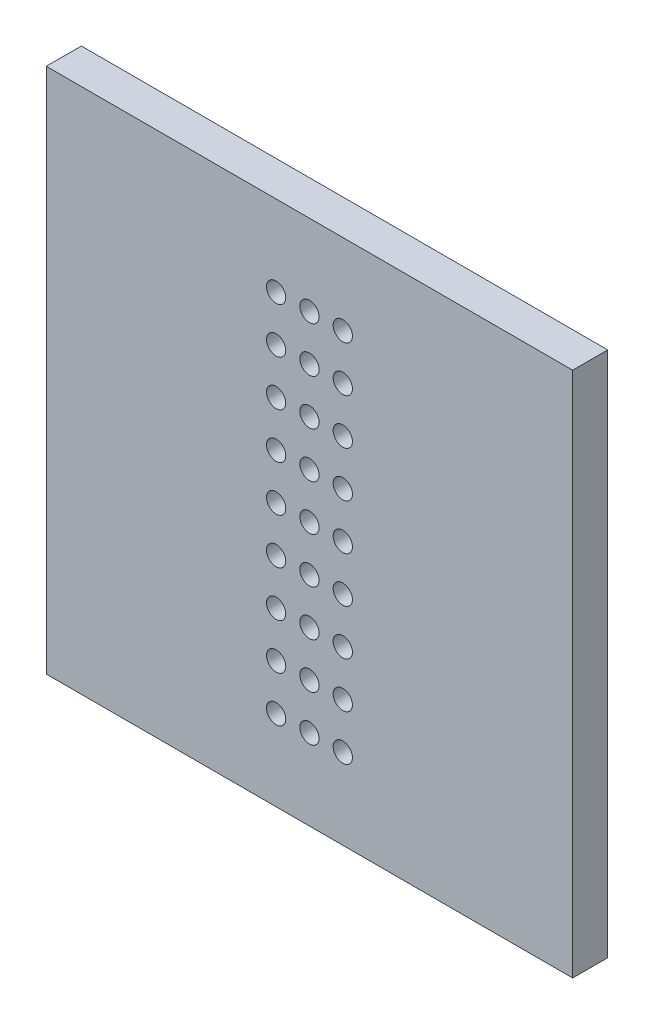
ISO-10303-21;
HEADER;
FILE_DESCRIPTION(('STEP AP214'),'2;1');
FILE_NAME('part.step','',(''),(''),'','','');
FILE_SCHEMA(('AUTOMOTIVE_DESIGN { 1 0 10303 214 1 1 1 1 }'));
ENDSEC;
DATA;
#1=APPLICATION_CONTEXT('core data for automotive mechanical design processes');
#2=APPLICATION_PROTOCOL_DEFINITION('international standard','automotive_design',2000,#1);
#3=PRODUCT_CONTEXT('',#1,'mechanical');
#4=PRODUCT('Part','Part','',(#3));
#5=PRODUCT_RELATED_PRODUCT_CATEGORY('part','',(#4));
#6=PRODUCT_DEFINITION_FORMATION('','',#4);
#7=PRODUCT_DEFINITION_CONTEXT('part definition',#1,'design');
#8=PRODUCT_DEFINITION('design','',#6,#7);
#9=PRODUCT_DEFINITION_SHAPE('','',#8);
#10=(LENGTH_UNIT() NAMED_UNIT(*) SI_UNIT(.MILLI.,.METRE.));
#11=(NAMED_UNIT(*) PLANE_ANGLE_UNIT() SI_UNIT($,.RADIAN.));
#12=(NAMED_UNIT(*) SI_UNIT($,.STERADIAN.) SOLID_ANGLE_UNIT());
#13=UNCERTAINTY_MEASURE_WITH_UNIT(LENGTH_MEASURE(1.E-05),#10,'distance_accuracy_value','');
#14=(GEOMETRIC_REPRESENTATION_CONTEXT(3) GLOBAL_UNCERTAINTY_ASSIGNED_CONTEXT((#13)) GLOBAL_UNIT_ASSIGNED_CONTEXT((#10,
#11,#12)) REPRESENTATION_CONTEXT('',''));
#15=CARTESIAN_POINT('',(0.,0.,0.));
#16=DIRECTION('',(0.,0.,1.));
#17=DIRECTION('',(1.,0.,0.));
#18=AXIS2_PLACEMENT_3D('',#15,#16,#17);
#19=CARTESIAN_POINT('',(15.,-15.,2.));
#20=DIRECTION('',(-1.,0.,0.));
#21=DIRECTION('',(0.,0.,1.));
#22=AXIS2_PLACEMENT_3D('',#19,#20,#21);
#23=PLANE('',#22);
#24=DIRECTION('',(0.,1.,0.));
#25=VECTOR('',#24,1.);
#26=CARTESIAN_POINT('',(15.,-15.,0.));
#27=LINE('',#26,#25);
#28=CARTESIAN_POINT('',(15.,-15.,0.));
#29=VERTEX_POINT('',#28);
#30=CARTESIAN_POINT('',(15.,15.,0.));
#31=VERTEX_POINT('',#30);
#32=EDGE_CURVE('E103',#29,#31,#27,.T.);
#33=ORIENTED_EDGE('',*,*,#32,.T.);
#34=DIRECTION('',(0.,0.,-1.));
#35=VECTOR('',#34,1.);
#36=CARTESIAN_POINT('',(15.,15.,2.));
#37=LINE('',#36,#35);
#38=CARTESIAN_POINT('',(15.,15.,2.));
#39=VERTEX_POINT('',#38);
#40=EDGE_CURVE('E11',#39,#31,#37,.T.);
#41=ORIENTED_EDGE('',*,*,#40,.F.);
#42=DIRECTION('',(0.,1.,0.));
#43=VECTOR('',#42,1.);
#44=CARTESIAN_POINT('',(15.,-15.,2.));
#45=LINE('',#44,#43);
#46=CARTESIAN_POINT('',(15.,-15.,2.));
#47=VERTEX_POINT('',#46);
#48=EDGE_CURVE('E90',#47,#39,#45,.T.);
#49=ORIENTED_EDGE('',*,*,#48,.F.);
#50=DIRECTION('',(0.,0.,-1.));
#51=VECTOR('',#50,1.);
#52=CARTESIAN_POINT('',(15.,-15.,2.));
#53=LINE('',#52,#51);
#54=EDGE_CURVE('E99',#47,#29,#53,.T.);
#55=ORIENTED_EDGE('',*,*,#54,.T.);
#56=EDGE_LOOP('',(#33,#41,#49,#55));
#57=FACE_BOUND('',#56,.T.);
#58=ADVANCED_FACE('F37',(#57),#23,.F.);
#59=CARTESIAN_POINT('',(-15.,15.,2.));
#60=DIRECTION('',(0.,-1.,0.));
#61=DIRECTION('',(0.,0.,-1.));
#62=AXIS2_PLACEMENT_3D('',#59,#60,#61);
#63=PLANE('',#62);
#64=DIRECTION('',(-1.,0.,0.));
#65=VECTOR('',#64,1.);
#66=CARTESIAN_POINT('',(-15.,15.,0.));
#67=LINE('',#66,#65);
#68=CARTESIAN_POINT('',(-15.,15.,0.));
#69=VERTEX_POINT('',#68);
#70=EDGE_CURVE('E94',#31,#69,#67,.T.);
#71=ORIENTED_EDGE('',*,*,#70,.T.);
#72=DIRECTION('',(0.,0.,-1.));
#73=VECTOR('',#72,1.);
#74=CARTESIAN_POINT('',(-15.,15.,2.));
#75=LINE('',#74,#73);
#76=CARTESIAN_POINT('',(-15.,15.,2.));
#77=VERTEX_POINT('',#76);
#78=EDGE_CURVE('E46',#77,#69,#75,.T.);
#79=ORIENTED_EDGE('',*,*,#78,.F.);
#80=DIRECTION('',(-1.,0.,0.));
#81=VECTOR('',#80,1.);
#82=CARTESIAN_POINT('',(-15.,15.,2.));
#83=LINE('',#82,#81);
#84=EDGE_CURVE('E85',#39,#77,#83,.T.);
#85=ORIENTED_EDGE('',*,*,#84,.F.);
#86=ORIENTED_EDGE('',*,*,#40,.T.);
#87=EDGE_LOOP('',(#71,#79,#85,#86));
#88=FACE_BOUND('',#87,.T.);
#89=ADVANCED_FACE('F93',(#88),#63,.F.);
#90=CARTESIAN_POINT('',(-15.,-15.,2.));
#91=DIRECTION('',(1.,0.,0.));
#92=DIRECTION('',(0.,0.,-1.));
#93=AXIS2_PLACEMENT_3D('',#90,#91,#92);
#94=PLANE('',#93);
#95=DIRECTION('',(0.,-1.,0.));
#96=VECTOR('',#95,1.);
#97=CARTESIAN_POINT('',(-15.,-15.,0.));
#98=LINE('',#97,#96);
#99=CARTESIAN_POINT('',(-15.,-15.,0.));
#100=VERTEX_POINT('',#99);
#101=EDGE_CURVE('E72',#69,#100,#98,.T.);
#102=ORIENTED_EDGE('',*,*,#101,.T.);
#103=DIRECTION('',(0.,0.,-1.));
#104=VECTOR('',#103,1.);
#105=CARTESIAN_POINT('',(-15.,-15.,2.));
#106=LINE('',#105,#104);
#107=CARTESIAN_POINT('',(-15.,-15.,2.));
#108=VERTEX_POINT('',#107);
#109=EDGE_CURVE('E95',#108,#100,#106,.T.);
#110=ORIENTED_EDGE('',*,*,#109,.F.);
#111=DIRECTION('',(0.,-1.,0.));
#112=VECTOR('',#111,1.);
#113=CARTESIAN_POINT('',(-15.,-15.,2.));
#114=LINE('',#113,#112);
#115=EDGE_CURVE('E88',#77,#108,#114,.T.);
#116=ORIENTED_EDGE('',*,*,#115,.F.);
#117=ORIENTED_EDGE('',*,*,#78,.T.);
#118=EDGE_LOOP('',(#102,#110,#116,#117));
#119=FACE_BOUND('',#118,.T.);
#120=ADVANCED_FACE('F97',(#119),#94,.F.);
#121=CARTESIAN_POINT('',(-15.,-15.,2.));
#122=DIRECTION('',(0.,1.,0.));
#123=DIRECTION('',(0.,0.,1.));
#124=AXIS2_PLACEMENT_3D('',#121,#122,#123);
#125=PLANE('',#124);
#126=DIRECTION('',(1.,0.,0.));
#127=VECTOR('',#126,1.);
#128=CARTESIAN_POINT('',(-15.,-15.,0.));
#129=LINE('',#128,#127);
#130=EDGE_CURVE('E78',#100,#29,#129,.T.);
#131=ORIENTED_EDGE('',*,*,#130,.T.);
#132=ORIENTED_EDGE('',*,*,#54,.F.);
#133=DIRECTION('',(1.,0.,0.));
#134=VECTOR('',#133,1.);
#135=CARTESIAN_POINT('',(-15.,-15.,2.));
#136=LINE('',#135,#134);
#137=EDGE_CURVE('E55',#108,#47,#136,.T.);
#138=ORIENTED_EDGE('',*,*,#137,.F.);
#139=ORIENTED_EDGE('',*,*,#109,.T.);
#140=EDGE_LOOP('',(#131,#132,#138,#139));
#141=FACE_BOUND('',#140,.T.);
#142=ADVANCED_FACE('F254',(#141),#125,.F.);
#143=CARTESIAN_POINT('',(0.,0.,2.));
#144=DIRECTION('',(0.,0.,-1.));
#145=DIRECTION('',(-1.,0.,0.));
#146=AXIS2_PLACEMENT_3D('',#143,#144,#145);
#147=PLANE('',#146);
#148=CARTESIAN_POINT('',(-1.9,-7.8,2.));
#149=DIRECTION('',(0.,0.,1.));
#150=DIRECTION('',(1.,0.,0.));
#151=AXIS2_PLACEMENT_3D('',#148,#149,#150);
#152=CIRCLE('',#151,0.55);
#153=CARTESIAN_POINT('',(-1.35,-7.8,2.));
#154=VERTEX_POINT('',#153);
#155=EDGE_CURVE('E637',#154,#154,#152,.T.);
#156=ORIENTED_EDGE('',*,*,#155,.F.);
#157=EDGE_LOOP('',(#156));
#158=FACE_BOUND('',#157,.T.);
#159=CARTESIAN_POINT('',(-1.9,-5.2,2.));
#160=DIRECTION('',(0.,0.,1.));
#161=DIRECTION('',(1.,0.,0.));
#162=AXIS2_PLACEMENT_3D('',#159,#160,#161);
#163=CIRCLE('',#162,0.55);
#164=CARTESIAN_POINT('',(-1.35,-5.2,2.));
#165=VERTEX_POINT('',#164);
#166=EDGE_CURVE('E635',#165,#165,#163,.T.);
#167=ORIENTED_EDGE('',*,*,#166,.F.);
#168=EDGE_LOOP('',(#167));
#169=FACE_BOUND('',#168,.T.);
#170=CARTESIAN_POINT('',(-1.9,-2.6,2.));
#171=DIRECTION('',(0.,0.,1.));
#172=DIRECTION('',(1.,0.,0.));
#173=AXIS2_PLACEMENT_3D('',#170,#171,#172);
#174=CIRCLE('',#173,0.55);
#175=CARTESIAN_POINT('',(-1.35,-2.6,2.));
#176=VERTEX_POINT('',#175);
#177=EDGE_CURVE('E638',#176,#176,#174,.T.);
#178=ORIENTED_EDGE('',*,*,#177,.F.);
#179=EDGE_LOOP('',(#178));
#180=FACE_BOUND('',#179,.T.);
#181=CARTESIAN_POINT('',(-1.9,0.,2.));
#182=DIRECTION('',(0.,0.,1.));
#183=DIRECTION('',(1.,0.,0.));
#184=AXIS2_PLACEMENT_3D('',#181,#182,#183);
#185=CIRCLE('',#184,0.55);
#186=CARTESIAN_POINT('',(-1.35,0.,2.));
#187=VERTEX_POINT('',#186);
#188=EDGE_CURVE('E643',#187,#187,#185,.T.);
#189=ORIENTED_EDGE('',*,*,#188,.F.);
#190=EDGE_LOOP('',(#189));
#191=FACE_BOUND('',#190,.T.);
#192=CARTESIAN_POINT('',(-1.9,2.6,2.));
#193=DIRECTION('',(0.,0.,1.));
#194=DIRECTION('',(1.,0.,0.));
#195=AXIS2_PLACEMENT_3D('',#192,#193,#194);
#196=CIRCLE('',#195,0.55);
#197=CARTESIAN_POINT('',(-1.35,2.6,2.));
#198=VERTEX_POINT('',#197);
#199=EDGE_CURVE('E649',#198,#198,#196,.T.);
#200=ORIENTED_EDGE('',*,*,#199,.F.);
#201=EDGE_LOOP('',(#200));
#202=FACE_BOUND('',#201,.T.);
#203=CARTESIAN_POINT('',(-1.9,5.2,2.));
#204=DIRECTION('',(0.,0.,1.));
#205=DIRECTION('',(1.,0.,0.));
#206=AXIS2_PLACEMENT_3D('',#203,#204,#205);
#207=CIRCLE('',#206,0.55);
#208=CARTESIAN_POINT('',(-1.35,5.2,2.));
#209=VERTEX_POINT('',#208);
#210=EDGE_CURVE('E652',#209,#209,#207,.T.);
#211=ORIENTED_EDGE('',*,*,#210,.F.);
#212=EDGE_LOOP('',(#211));
#213=FACE_BOUND('',#212,.T.);
#214=CARTESIAN_POINT('',(-1.9,7.8,2.));
#215=DIRECTION('',(0.,0.,1.));
#216=DIRECTION('',(1.,0.,0.));
#217=AXIS2_PLACEMENT_3D('',#214,#215,#216);
#218=CIRCLE('',#217,0.55);
#219=CARTESIAN_POINT('',(-1.35,7.8,2.));
#220=VERTEX_POINT('',#219);
#221=EDGE_CURVE('E655',#220,#220,#218,.T.);
#222=ORIENTED_EDGE('',*,*,#221,.F.);
#223=EDGE_LOOP('',(#222));
#224=FACE_BOUND('',#223,.T.);
#225=CARTESIAN_POINT('',(-1.9,10.4,2.));
#226=DIRECTION('',(0.,0.,1.));
#227=DIRECTION('',(1.,0.,0.));
#228=AXIS2_PLACEMENT_3D('',#225,#226,#227);
#229=CIRCLE('',#228,0.55);
#230=CARTESIAN_POINT('',(-1.35,10.4,2.));
#231=VERTEX_POINT('',#230);
#232=EDGE_CURVE('E658',#231,#231,#229,.T.);
#233=ORIENTED_EDGE('',*,*,#232,.F.);
#234=EDGE_LOOP('',(#233));
#235=FACE_BOUND('',#234,.T.);
#236=CARTESIAN_POINT('',(0.,-10.4,2.));
#237=DIRECTION('',(0.,0.,1.));
#238=DIRECTION('',(1.,0.,0.));
#239=AXIS2_PLACEMENT_3D('',#236,#237,#238);
#240=CIRCLE('',#239,0.55);
#241=CARTESIAN_POINT('',(0.55,-10.4,2.));
#242=VERTEX_POINT('',#241);
#243=EDGE_CURVE('E661',#242,#242,#240,.T.);
#244=ORIENTED_EDGE('',*,*,#243,.F.);
#245=EDGE_LOOP('',(#244));
#246=FACE_BOUND('',#245,.T.);
#247=CARTESIAN_POINT('',(0.,-7.8,2.));
#248=DIRECTION('',(0.,0.,1.));
#249=DIRECTION('',(1.,0.,0.));
#250=AXIS2_PLACEMENT_3D('',#247,#248,#249);
#251=CIRCLE('',#250,0.55);
#252=CARTESIAN_POINT('',(0.55,-7.8,2.));
#253=VERTEX_POINT('',#252);
#254=EDGE_CURVE('E664',#253,#253,#251,.T.);
#255=ORIENTED_EDGE('',*,*,#254,.F.);
#256=EDGE_LOOP('',(#255));
#257=FACE_BOUND('',#256,.T.);
#258=CARTESIAN_POINT('',(0.,-5.2,2.));
#259=DIRECTION('',(0.,0.,1.));
#260=DIRECTION('',(1.,0.,0.));
#261=AXIS2_PLACEMENT_3D('',#258,#259,#260);
#262=CIRCLE('',#261,0.55);
#263=CARTESIAN_POINT('',(0.55,-5.2,2.));
#264=VERTEX_POINT('',#263);
#265=EDGE_CURVE('E667',#264,#264,#262,.T.);
#266=ORIENTED_EDGE('',*,*,#265,.F.);
#267=EDGE_LOOP('',(#266));
#268=FACE_BOUND('',#267,.T.);
#269=CARTESIAN_POINT('',(0.,-2.6,2.));
#270=DIRECTION('',(0.,0.,1.));
#271=DIRECTION('',(1.,0.,0.));
#272=AXIS2_PLACEMENT_3D('',#269,#270,#271);
#273=CIRCLE('',#272,0.55);
#274=CARTESIAN_POINT('',(0.55,-2.6,2.));
#275=VERTEX_POINT('',#274);
#276=EDGE_CURVE('E670',#275,#275,#273,.T.);
#277=ORIENTED_EDGE('',*,*,#276,.F.);
#278=EDGE_LOOP('',(#277));
#279=FACE_BOUND('',#278,.T.);
#280=CARTESIAN_POINT('',(0.,0.,2.));
#281=DIRECTION('',(0.,0.,1.));
#282=DIRECTION('',(1.,0.,0.));
#283=AXIS2_PLACEMENT_3D('',#280,#281,#282);
#284=CIRCLE('',#283,0.55);
#285=CARTESIAN_POINT('',(0.55,0.,2.));
#286=VERTEX_POINT('',#285);
#287=EDGE_CURVE('E673',#286,#286,#284,.T.);
#288=ORIENTED_EDGE('',*,*,#287,.F.);
#289=EDGE_LOOP('',(#288));
#290=FACE_BOUND('',#289,.T.);
#291=CARTESIAN_POINT('',(0.,2.6,2.));
#292=DIRECTION('',(0.,0.,1.));
#293=DIRECTION('',(1.,0.,0.));
#294=AXIS2_PLACEMENT_3D('',#291,#292,#293);
#295=CIRCLE('',#294,0.55);
#296=CARTESIAN_POINT('',(0.55,2.6,2.));
#297=VERTEX_POINT('',#296);
#298=EDGE_CURVE('E676',#297,#297,#295,.T.);
#299=ORIENTED_EDGE('',*,*,#298,.F.);
#300=EDGE_LOOP('',(#299));
#301=FACE_BOUND('',#300,.T.);
#302=CARTESIAN_POINT('',(0.,5.2,2.));
#303=DIRECTION('',(0.,0.,1.));
#304=DIRECTION('',(1.,0.,0.));
#305=AXIS2_PLACEMENT_3D('',#302,#303,#304);
#306=CIRCLE('',#305,0.55);
#307=CARTESIAN_POINT('',(0.55,5.2,2.));
#308=VERTEX_POINT('',#307);
#309=EDGE_CURVE('E679',#308,#308,#306,.T.);
#310=ORIENTED_EDGE('',*,*,#309,.F.);
#311=EDGE_LOOP('',(#310));
#312=FACE_BOUND('',#311,.T.);
#313=CARTESIAN_POINT('',(0.,7.8,2.));
#314=DIRECTION('',(0.,0.,1.));
#315=DIRECTION('',(1.,0.,0.));
#316=AXIS2_PLACEMENT_3D('',#313,#314,#315);
#317=CIRCLE('',#316,0.55);
#318=CARTESIAN_POINT('',(0.55,7.8,2.));
#319=VERTEX_POINT('',#318);
#320=EDGE_CURVE('E682',#319,#319,#317,.T.);
#321=ORIENTED_EDGE('',*,*,#320,.F.);
#322=EDGE_LOOP('',(#321));
#323=FACE_BOUND('',#322,.T.);
#324=CARTESIAN_POINT('',(1.9,10.4,2.));
#325=DIRECTION('',(0.,0.,1.));
#326=DIRECTION('',(1.,0.,0.));
#327=AXIS2_PLACEMENT_3D('',#324,#325,#326);
#328=CIRCLE('',#327,0.55);
#329=CARTESIAN_POINT('',(2.45,10.4,2.));
#330=VERTEX_POINT('',#329);
#331=EDGE_CURVE('E718',#330,#330,#328,.T.);
#332=ORIENTED_EDGE('',*,*,#331,.F.);
#333=EDGE_LOOP('',(#332));
#334=FACE_BOUND('',#333,.T.);
#335=CARTESIAN_POINT('',(1.9,7.8,2.));
#336=DIRECTION('',(0.,0.,1.));
#337=DIRECTION('',(1.,0.,0.));
#338=AXIS2_PLACEMENT_3D('',#335,#336,#337);
#339=CIRCLE('',#338,0.55);
#340=CARTESIAN_POINT('',(2.45,7.8,2.));
#341=VERTEX_POINT('',#340);
#342=EDGE_CURVE('E710',#341,#341,#339,.T.);
#343=ORIENTED_EDGE('',*,*,#342,.F.);
#344=EDGE_LOOP('',(#343));
#345=FACE_BOUND('',#344,.T.);
#346=CARTESIAN_POINT('',(1.9,-5.2,2.));
#347=DIRECTION('',(0.,0.,1.));
#348=DIRECTION('',(1.,0.,0.));
#349=AXIS2_PLACEMENT_3D('',#346,#347,#348);
#350=CIRCLE('',#349,0.55);
#351=CARTESIAN_POINT('',(2.45,-5.2,2.));
#352=VERTEX_POINT('',#351);
#353=EDGE_CURVE('E700',#352,#352,#350,.T.);
#354=ORIENTED_EDGE('',*,*,#353,.F.);
#355=EDGE_LOOP('',(#354));
#356=FACE_BOUND('',#355,.T.);
#357=CARTESIAN_POINT('',(1.9,-7.8,2.));
#358=DIRECTION('',(0.,0.,1.));
#359=DIRECTION('',(1.,0.,0.));
#360=AXIS2_PLACEMENT_3D('',#357,#358,#359);
#361=CIRCLE('',#360,0.55);
#362=CARTESIAN_POINT('',(2.45,-7.8,2.));
#363=VERTEX_POINT('',#362);
#364=EDGE_CURVE('E698',#363,#363,#361,.T.);
#365=ORIENTED_EDGE('',*,*,#364,.F.);
#366=EDGE_LOOP('',(#365));
#367=FACE_BOUND('',#366,.T.);
#368=CARTESIAN_POINT('',(1.9,-10.4,2.));
#369=DIRECTION('',(0.,0.,1.));
#370=DIRECTION('',(1.,0.,0.));
#371=AXIS2_PLACEMENT_3D('',#368,#369,#370);
#372=CIRCLE('',#371,0.55);
#373=CARTESIAN_POINT('',(2.45,-10.4,2.));
#374=VERTEX_POINT('',#373);
#375=EDGE_CURVE('E693',#374,#374,#372,.T.);
#376=ORIENTED_EDGE('',*,*,#375,.F.);
#377=EDGE_LOOP('',(#376));
#378=FACE_BOUND('',#377,.T.);
#379=CARTESIAN_POINT('',(0.,10.4,2.));
#380=DIRECTION('',(0.,0.,1.));
#381=DIRECTION('',(1.,0.,0.));
#382=AXIS2_PLACEMENT_3D('',#379,#380,#381);
#383=CIRCLE('',#382,0.55);
#384=CARTESIAN_POINT('',(0.55,10.4,2.));
#385=VERTEX_POINT('',#384);
#386=EDGE_CURVE('E685',#385,#385,#383,.T.);
#387=ORIENTED_EDGE('',*,*,#386,.F.);
#388=EDGE_LOOP('',(#387));
#389=FACE_BOUND('',#388,.T.);
#390=CARTESIAN_POINT('',(1.9,-2.6,2.));
#391=DIRECTION('',(0.,0.,1.));
#392=DIRECTION('',(1.,0.,0.));
#393=AXIS2_PLACEMENT_3D('',#390,#391,#392);
#394=CIRCLE('',#393,0.55);
#395=CARTESIAN_POINT('',(2.45,-2.6,2.));
#396=VERTEX_POINT('',#395);
#397=EDGE_CURVE('E703',#396,#396,#394,.T.);
#398=ORIENTED_EDGE('',*,*,#397,.F.);
#399=EDGE_LOOP('',(#398));
#400=FACE_BOUND('',#399,.T.);
#401=CARTESIAN_POINT('',(1.9,0.,2.));
#402=DIRECTION('',(0.,0.,1.));
#403=DIRECTION('',(1.,0.,0.));
#404=AXIS2_PLACEMENT_3D('',#401,#402,#403);
#405=CIRCLE('',#404,0.55);
#406=CARTESIAN_POINT('',(2.45,0.,2.));
#407=VERTEX_POINT('',#406);
#408=EDGE_CURVE('E713',#407,#407,#405,.T.);
#409=ORIENTED_EDGE('',*,*,#408,.F.);
#410=EDGE_LOOP('',(#409));
#411=FACE_BOUND('',#410,.T.);
#412=CARTESIAN_POINT('',(1.9,2.6,2.));
#413=DIRECTION('',(0.,0.,1.));
#414=DIRECTION('',(1.,0.,0.));
#415=AXIS2_PLACEMENT_3D('',#412,#413,#414);
#416=CIRCLE('',#415,0.55);
#417=CARTESIAN_POINT('',(2.45,2.6,2.));
#418=VERTEX_POINT('',#417);
#419=EDGE_CURVE('E709',#418,#418,#416,.T.);
#420=ORIENTED_EDGE('',*,*,#419,.F.);
#421=EDGE_LOOP('',(#420));
#422=FACE_BOUND('',#421,.T.);
#423=CARTESIAN_POINT('',(1.9,5.2,2.));
#424=DIRECTION('',(0.,0.,1.));
#425=DIRECTION('',(1.,0.,0.));
#426=AXIS2_PLACEMENT_3D('',#423,#424,#425);
#427=CIRCLE('',#426,0.55);
#428=CARTESIAN_POINT('',(2.45,5.2,2.));
#429=VERTEX_POINT('',#428);
#430=EDGE_CURVE('E706',#429,#429,#427,.T.);
#431=ORIENTED_EDGE('',*,*,#430,.F.);
#432=EDGE_LOOP('',(#431));
#433=FACE_BOUND('',#432,.T.);
#434=CARTESIAN_POINT('',(-1.9,-10.4,2.));
#435=DIRECTION('',(0.,0.,1.));
#436=DIRECTION('',(1.,0.,0.));
#437=AXIS2_PLACEMENT_3D('',#434,#435,#436);
#438=CIRCLE('',#437,0.55);
#439=CARTESIAN_POINT('',(-1.35,-10.4,2.));
#440=VERTEX_POINT('',#439);
#441=EDGE_CURVE('E115',#440,#440,#438,.T.);
#442=ORIENTED_EDGE('',*,*,#441,.F.);
#443=EDGE_LOOP('',(#442));
#444=FACE_BOUND('',#443,.T.);
#445=ORIENTED_EDGE('',*,*,#48,.T.);
#446=ORIENTED_EDGE('',*,*,#84,.T.);
#447=ORIENTED_EDGE('',*,*,#115,.T.);
#448=ORIENTED_EDGE('',*,*,#137,.T.);
#449=EDGE_LOOP('',(#445,#446,#447,#448));
#450=FACE_BOUND('',#449,.T.);
#451=ADVANCED_FACE('F86',(#158,#169,#180,#191,#202,#213,#224,#235,#246,#257,#268,#279,#290,#301,
#312,#323,#334,#345,#356,#367,#378,#389,#400,#411,#422,#433,#444,#450),#147,.F.);
#452=CARTESIAN_POINT('',(0.,0.,0.));
#453=DIRECTION('',(0.,0.,-1.));
#454=DIRECTION('',(-1.,0.,0.));
#455=AXIS2_PLACEMENT_3D('',#452,#453,#454);
#456=PLANE('',#455);
#457=CARTESIAN_POINT('',(-1.9,-7.8,0.));
#458=DIRECTION('',(0.,0.,-1.));
#459=DIRECTION('',(-1.,0.,0.));
#460=AXIS2_PLACEMENT_3D('',#457,#458,#459);
#461=CIRCLE('',#460,0.55);
#462=CARTESIAN_POINT('',(-2.45,-7.8,0.));
#463=VERTEX_POINT('',#462);
#464=EDGE_CURVE('E40',#463,#463,#461,.T.);
#465=ORIENTED_EDGE('',*,*,#464,.F.);
#466=EDGE_LOOP('',(#465));
#467=FACE_BOUND('',#466,.T.);
#468=CARTESIAN_POINT('',(-1.9,-5.2,0.));
#469=DIRECTION('',(0.,0.,-1.));
#470=DIRECTION('',(-1.,0.,0.));
#471=AXIS2_PLACEMENT_3D('',#468,#469,#470);
#472=CIRCLE('',#471,0.55);
#473=CARTESIAN_POINT('',(-2.45,-5.2,0.));
#474=VERTEX_POINT('',#473);
#475=EDGE_CURVE('E186',#474,#474,#472,.T.);
#476=ORIENTED_EDGE('',*,*,#475,.F.);
#477=EDGE_LOOP('',(#476));
#478=FACE_BOUND('',#477,.T.);
#479=CARTESIAN_POINT('',(-1.9,-2.6,0.));
#480=DIRECTION('',(0.,0.,-1.));
#481=DIRECTION('',(-1.,0.,0.));
#482=AXIS2_PLACEMENT_3D('',#479,#480,#481);
#483=CIRCLE('',#482,0.55);
#484=CARTESIAN_POINT('',(-2.45,-2.6,0.));
#485=VERTEX_POINT('',#484);
#486=EDGE_CURVE('E184',#485,#485,#483,.T.);
#487=ORIENTED_EDGE('',*,*,#486,.F.);
#488=EDGE_LOOP('',(#487));
#489=FACE_BOUND('',#488,.T.);
#490=CARTESIAN_POINT('',(-1.9,0.,0.));
#491=DIRECTION('',(0.,0.,-1.));
#492=DIRECTION('',(-1.,0.,0.));
#493=AXIS2_PLACEMENT_3D('',#490,#491,#492);
#494=CIRCLE('',#493,0.55);
#495=CARTESIAN_POINT('',(-2.45,0.,0.));
#496=VERTEX_POINT('',#495);
#497=EDGE_CURVE('E181',#496,#496,#494,.T.);
#498=ORIENTED_EDGE('',*,*,#497,.F.);
#499=EDGE_LOOP('',(#498));
#500=FACE_BOUND('',#499,.T.);
#501=CARTESIAN_POINT('',(-1.9,2.6,0.));
#502=DIRECTION('',(0.,0.,-1.));
#503=DIRECTION('',(-1.,0.,0.));
#504=AXIS2_PLACEMENT_3D('',#501,#502,#503);
#505=CIRCLE('',#504,0.55);
#506=CARTESIAN_POINT('',(-2.45,2.6,0.));
#507=VERTEX_POINT('',#506);
#508=EDGE_CURVE('E178',#507,#507,#505,.T.);
#509=ORIENTED_EDGE('',*,*,#508,.F.);
#510=EDGE_LOOP('',(#509));
#511=FACE_BOUND('',#510,.T.);
#512=CARTESIAN_POINT('',(-1.9,5.2,0.));
#513=DIRECTION('',(0.,0.,-1.));
#514=DIRECTION('',(-1.,0.,0.));
#515=AXIS2_PLACEMENT_3D('',#512,#513,#514);
#516=CIRCLE('',#515,0.55);
#517=CARTESIAN_POINT('',(-2.45,5.2,0.));
#518=VERTEX_POINT('',#517);
#519=EDGE_CURVE('E175',#518,#518,#516,.T.);
#520=ORIENTED_EDGE('',*,*,#519,.F.);
#521=EDGE_LOOP('',(#520));
#522=FACE_BOUND('',#521,.T.);
#523=CARTESIAN_POINT('',(-1.9,7.8,0.));
#524=DIRECTION('',(0.,0.,-1.));
#525=DIRECTION('',(-1.,0.,0.));
#526=AXIS2_PLACEMENT_3D('',#523,#524,#525);
#527=CIRCLE('',#526,0.55);
#528=CARTESIAN_POINT('',(-2.45,7.8,0.));
#529=VERTEX_POINT('',#528);
#530=EDGE_CURVE('E172',#529,#529,#527,.T.);
#531=ORIENTED_EDGE('',*,*,#530,.F.);
#532=EDGE_LOOP('',(#531));
#533=FACE_BOUND('',#532,.T.);
#534=CARTESIAN_POINT('',(-1.9,10.4,0.));
#535=DIRECTION('',(0.,0.,-1.));
#536=DIRECTION('',(-1.,0.,0.));
#537=AXIS2_PLACEMENT_3D('',#534,#535,#536);
#538=CIRCLE('',#537,0.55);
#539=CARTESIAN_POINT('',(-2.45,10.4,0.));
#540=VERTEX_POINT('',#539);
#541=EDGE_CURVE('E169',#540,#540,#538,.T.);
#542=ORIENTED_EDGE('',*,*,#541,.F.);
#543=EDGE_LOOP('',(#542));
#544=FACE_BOUND('',#543,.T.);
#545=CARTESIAN_POINT('',(0.,-10.4,0.));
#546=DIRECTION('',(0.,0.,-1.));
#547=DIRECTION('',(-1.,0.,0.));
#548=AXIS2_PLACEMENT_3D('',#545,#546,#547);
#549=CIRCLE('',#548,0.55);
#550=CARTESIAN_POINT('',(-0.55,-10.4,0.));
#551=VERTEX_POINT('',#550);
#552=EDGE_CURVE('E166',#551,#551,#549,.T.);
#553=ORIENTED_EDGE('',*,*,#552,.F.);
#554=EDGE_LOOP('',(#553));
#555=FACE_BOUND('',#554,.T.);
#556=CARTESIAN_POINT('',(0.,-7.8,0.));
#557=DIRECTION('',(0.,0.,-1.));
#558=DIRECTION('',(-1.,0.,0.));
#559=AXIS2_PLACEMENT_3D('',#556,#557,#558);
#560=CIRCLE('',#559,0.55);
#561=CARTESIAN_POINT('',(-0.55,-7.8,0.));
#562=VERTEX_POINT('',#561);
#563=EDGE_CURVE('E163',#562,#562,#560,.T.);
#564=ORIENTED_EDGE('',*,*,#563,.F.);
#565=EDGE_LOOP('',(#564));
#566=FACE_BOUND('',#565,.T.);
#567=CARTESIAN_POINT('',(0.,-5.2,0.));
#568=DIRECTION('',(0.,0.,-1.));
#569=DIRECTION('',(-1.,0.,0.));
#570=AXIS2_PLACEMENT_3D('',#567,#568,#569);
#571=CIRCLE('',#570,0.55);
#572=CARTESIAN_POINT('',(-0.55,-5.2,0.));
#573=VERTEX_POINT('',#572);
#574=EDGE_CURVE('E160',#573,#573,#571,.T.);
#575=ORIENTED_EDGE('',*,*,#574,.F.);
#576=EDGE_LOOP('',(#575));
#577=FACE_BOUND('',#576,.T.);
#578=CARTESIAN_POINT('',(0.,-2.6,0.));
#579=DIRECTION('',(0.,0.,-1.));
#580=DIRECTION('',(-1.,0.,0.));
#581=AXIS2_PLACEMENT_3D('',#578,#579,#580);
#582=CIRCLE('',#581,0.55);
#583=CARTESIAN_POINT('',(-0.55,-2.6,0.));
#584=VERTEX_POINT('',#583);
#585=EDGE_CURVE('E157',#584,#584,#582,.T.);
#586=ORIENTED_EDGE('',*,*,#585,.F.);
#587=EDGE_LOOP('',(#586));
#588=FACE_BOUND('',#587,.T.);
#589=CARTESIAN_POINT('',(0.,0.,0.));
#590=DIRECTION('',(0.,0.,-1.));
#591=DIRECTION('',(-1.,0.,0.));
#592=AXIS2_PLACEMENT_3D('',#589,#590,#591);
#593=CIRCLE('',#592,0.55);
#594=CARTESIAN_POINT('',(-0.55,0.,0.));
#595=VERTEX_POINT('',#594);
#596=EDGE_CURVE('E154',#595,#595,#593,.T.);
#597=ORIENTED_EDGE('',*,*,#596,.F.);
#598=EDGE_LOOP('',(#597));
#599=FACE_BOUND('',#598,.T.);
#600=CARTESIAN_POINT('',(0.,2.6,0.));
#601=DIRECTION('',(0.,0.,-1.));
#602=DIRECTION('',(-1.,0.,0.));
#603=AXIS2_PLACEMENT_3D('',#600,#601,#602);
#604=CIRCLE('',#603,0.55);
#605=CARTESIAN_POINT('',(-0.55,2.6,0.));
#606=VERTEX_POINT('',#605);
#607=EDGE_CURVE('E151',#606,#606,#604,.T.);
#608=ORIENTED_EDGE('',*,*,#607,.F.);
#609=EDGE_LOOP('',(#608));
#610=FACE_BOUND('',#609,.T.);
#611=CARTESIAN_POINT('',(0.,5.2,0.));
#612=DIRECTION('',(0.,0.,-1.));
#613=DIRECTION('',(-1.,0.,0.));
#614=AXIS2_PLACEMENT_3D('',#611,#612,#613);
#615=CIRCLE('',#614,0.55);
#616=CARTESIAN_POINT('',(-0.55,5.2,0.));
#617=VERTEX_POINT('',#616);
#618=EDGE_CURVE('E148',#617,#617,#615,.T.);
#619=ORIENTED_EDGE('',*,*,#618,.F.);
#620=EDGE_LOOP('',(#619));
#621=FACE_BOUND('',#620,.T.);
#622=CARTESIAN_POINT('',(0.,7.8,0.));
#623=DIRECTION('',(0.,0.,-1.));
#624=DIRECTION('',(-1.,0.,0.));
#625=AXIS2_PLACEMENT_3D('',#622,#623,#624);
#626=CIRCLE('',#625,0.55);
#627=CARTESIAN_POINT('',(-0.55,7.8,0.));
#628=VERTEX_POINT('',#627);
#629=EDGE_CURVE('E145',#628,#628,#626,.T.);
#630=ORIENTED_EDGE('',*,*,#629,.F.);
#631=EDGE_LOOP('',(#630));
#632=FACE_BOUND('',#631,.T.);
#633=CARTESIAN_POINT('',(1.9,10.4,0.));
#634=DIRECTION('',(0.,0.,-1.));
#635=DIRECTION('',(-1.,0.,0.));
#636=AXIS2_PLACEMENT_3D('',#633,#634,#635);
#637=CIRCLE('',#636,0.55);
#638=CARTESIAN_POINT('',(1.35,10.4,0.));
#639=VERTEX_POINT('',#638);
#640=EDGE_CURVE('E142',#639,#639,#637,.T.);
#641=ORIENTED_EDGE('',*,*,#640,.F.);
#642=EDGE_LOOP('',(#641));
#643=FACE_BOUND('',#642,.T.);
#644=CARTESIAN_POINT('',(1.9,7.8,0.));
#645=DIRECTION('',(0.,0.,-1.));
#646=DIRECTION('',(-1.,0.,0.));
#647=AXIS2_PLACEMENT_3D('',#644,#645,#646);
#648=CIRCLE('',#647,0.55);
#649=CARTESIAN_POINT('',(1.35,7.8,0.));
#650=VERTEX_POINT('',#649);
#651=EDGE_CURVE('E139',#650,#650,#648,.T.);
#652=ORIENTED_EDGE('',*,*,#651,.F.);
#653=EDGE_LOOP('',(#652));
#654=FACE_BOUND('',#653,.T.);
#655=CARTESIAN_POINT('',(1.9,-5.2,0.));
#656=DIRECTION('',(0.,0.,-1.));
#657=DIRECTION('',(-1.,0.,0.));
#658=AXIS2_PLACEMENT_3D('',#655,#656,#657);
#659=CIRCLE('',#658,0.55);
#660=CARTESIAN_POINT('',(1.35,-5.2,0.));
#661=VERTEX_POINT('',#660);
#662=EDGE_CURVE('E136',#661,#661,#659,.T.);
#663=ORIENTED_EDGE('',*,*,#662,.F.);
#664=EDGE_LOOP('',(#663));
#665=FACE_BOUND('',#664,.T.);
#666=CARTESIAN_POINT('',(1.9,-7.8,0.));
#667=DIRECTION('',(0.,0.,-1.));
#668=DIRECTION('',(-1.,0.,0.));
#669=AXIS2_PLACEMENT_3D('',#666,#667,#668);
#670=CIRCLE('',#669,0.55);
#671=CARTESIAN_POINT('',(1.35,-7.8,0.));
#672=VERTEX_POINT('',#671);
#673=EDGE_CURVE('E133',#672,#672,#670,.T.);
#674=ORIENTED_EDGE('',*,*,#673,.F.);
#675=EDGE_LOOP('',(#674));
#676=FACE_BOUND('',#675,.T.);
#677=CARTESIAN_POINT('',(1.9,-10.4,0.));
#678=DIRECTION('',(0.,0.,-1.));
#679=DIRECTION('',(-1.,0.,0.));
#680=AXIS2_PLACEMENT_3D('',#677,#678,#679);
#681=CIRCLE('',#680,0.55);
#682=CARTESIAN_POINT('',(1.35,-10.4,0.));
#683=VERTEX_POINT('',#682);
#684=EDGE_CURVE('E130',#683,#683,#681,.T.);
#685=ORIENTED_EDGE('',*,*,#684,.F.);
#686=EDGE_LOOP('',(#685));
#687=FACE_BOUND('',#686,.T.);
#688=CARTESIAN_POINT('',(0.,10.4,0.));
#689=DIRECTION('',(0.,0.,-1.));
#690=DIRECTION('',(-1.,0.,0.));
#691=AXIS2_PLACEMENT_3D('',#688,#689,#690);
#692=CIRCLE('',#691,0.55);
#693=CARTESIAN_POINT('',(-0.55,10.4,0.));
#694=VERTEX_POINT('',#693);
#695=EDGE_CURVE('E127',#694,#694,#692,.T.);
#696=ORIENTED_EDGE('',*,*,#695,.F.);
#697=EDGE_LOOP('',(#696));
#698=FACE_BOUND('',#697,.T.);
#699=CARTESIAN_POINT('',(1.9,-2.6,0.));
#700=DIRECTION('',(0.,0.,-1.));
#701=DIRECTION('',(-1.,0.,0.));
#702=AXIS2_PLACEMENT_3D('',#699,#700,#701);
#703=CIRCLE('',#702,0.55);
#704=CARTESIAN_POINT('',(1.35,-2.6,0.));
#705=VERTEX_POINT('',#704);
#706=EDGE_CURVE('E124',#705,#705,#703,.T.);
#707=ORIENTED_EDGE('',*,*,#706,.F.);
#708=EDGE_LOOP('',(#707));
#709=FACE_BOUND('',#708,.T.);
#710=CARTESIAN_POINT('',(1.9,0.,0.));
#711=DIRECTION('',(0.,0.,-1.));
#712=DIRECTION('',(-1.,0.,0.));
#713=AXIS2_PLACEMENT_3D('',#710,#711,#712);
#714=CIRCLE('',#713,0.55);
#715=CARTESIAN_POINT('',(1.35,0.,0.));
#716=VERTEX_POINT('',#715);
#717=EDGE_CURVE('E121',#716,#716,#714,.T.);
#718=ORIENTED_EDGE('',*,*,#717,.F.);
#719=EDGE_LOOP('',(#718));
#720=FACE_BOUND('',#719,.T.);
#721=CARTESIAN_POINT('',(1.9,2.6,0.));
#722=DIRECTION('',(0.,0.,-1.));
#723=DIRECTION('',(-1.,0.,0.));
#724=AXIS2_PLACEMENT_3D('',#721,#722,#723);
#725=CIRCLE('',#724,0.55);
#726=CARTESIAN_POINT('',(1.35,2.6,0.));
#727=VERTEX_POINT('',#726);
#728=EDGE_CURVE('E118',#727,#727,#725,.T.);
#729=ORIENTED_EDGE('',*,*,#728,.F.);
#730=EDGE_LOOP('',(#729));
#731=FACE_BOUND('',#730,.T.);
#732=CARTESIAN_POINT('',(1.9,5.2,0.));
#733=DIRECTION('',(0.,0.,-1.));
#734=DIRECTION('',(-1.,0.,0.));
#735=AXIS2_PLACEMENT_3D('',#732,#733,#734);
#736=CIRCLE('',#735,0.55);
#737=CARTESIAN_POINT('',(1.35,5.2,0.));
#738=VERTEX_POINT('',#737);
#739=EDGE_CURVE('E114',#738,#738,#736,.T.);
#740=ORIENTED_EDGE('',*,*,#739,.F.);
#741=EDGE_LOOP('',(#740));
#742=FACE_BOUND('',#741,.T.);
#743=CARTESIAN_POINT('',(-1.9,-10.4,0.));
#744=DIRECTION('',(0.,0.,-1.));
#745=DIRECTION('',(-1.,0.,0.));
#746=AXIS2_PLACEMENT_3D('',#743,#744,#745);
#747=CIRCLE('',#746,0.55);
#748=CARTESIAN_POINT('',(-2.45,-10.4,0.));
#749=VERTEX_POINT('',#748);
#750=EDGE_CURVE('E111',#749,#749,#747,.T.);
#751=ORIENTED_EDGE('',*,*,#750,.F.);
#752=EDGE_LOOP('',(#751));
#753=FACE_BOUND('',#752,.T.);
#754=ORIENTED_EDGE('',*,*,#32,.F.);
#755=ORIENTED_EDGE('',*,*,#130,.F.);
#756=ORIENTED_EDGE('',*,*,#101,.F.);
#757=ORIENTED_EDGE('',*,*,#70,.F.);
#758=EDGE_LOOP('',(#754,#755,#756,#757));
#759=FACE_BOUND('',#758,.T.);
#760=ADVANCED_FACE('F196',(#467,#478,#489,#500,#511,#522,#533,#544,#555,#566,#577,#588,#599,
#610,#621,#632,#643,#654,#665,#676,#687,#698,#709,#720,#731,#742,#753,#759),#456,.T.);
#761=CARTESIAN_POINT('',(-1.9,-10.4,-8.));
#762=DIRECTION('',(0.,0.,1.));
#763=DIRECTION('',(1.,0.,0.));
#764=AXIS2_PLACEMENT_3D('',#761,#762,#763);
#765=CYLINDRICAL_SURFACE('',#764,0.55);
#766=ORIENTED_EDGE('',*,*,#750,.T.);
#767=EDGE_LOOP('',(#766));
#768=FACE_BOUND('',#767,.T.);
#769=ORIENTED_EDGE('',*,*,#441,.T.);
#770=EDGE_LOOP('',(#769));
#771=FACE_BOUND('',#770,.T.);
#772=ADVANCED_FACE('F199',(#768,#771),#765,.F.);
#773=CARTESIAN_POINT('',(1.9,5.2,-8.));
#774=DIRECTION('',(0.,0.,1.));
#775=DIRECTION('',(1.,0.,0.));
#776=AXIS2_PLACEMENT_3D('',#773,#774,#775);
#777=CYLINDRICAL_SURFACE('',#776,0.55);
#778=ORIENTED_EDGE('',*,*,#739,.T.);
#779=EDGE_LOOP('',(#778));
#780=FACE_BOUND('',#779,.T.);
#781=ORIENTED_EDGE('',*,*,#430,.T.);
#782=EDGE_LOOP('',(#781));
#783=FACE_BOUND('',#782,.T.);
#784=ADVANCED_FACE('F303',(#780,#783),#777,.F.);
#785=CARTESIAN_POINT('',(1.9,2.6,-8.));
#786=DIRECTION('',(0.,0.,1.));
#787=DIRECTION('',(1.,0.,0.));
#788=AXIS2_PLACEMENT_3D('',#785,#786,#787);
#789=CYLINDRICAL_SURFACE('',#788,0.55);
#790=ORIENTED_EDGE('',*,*,#728,.T.);
#791=EDGE_LOOP('',(#790));
#792=FACE_BOUND('',#791,.T.);
#793=ORIENTED_EDGE('',*,*,#419,.T.);
#794=EDGE_LOOP('',(#793));
#795=FACE_BOUND('',#794,.T.);
#796=ADVANCED_FACE('F314',(#792,#795),#789,.F.);
#797=CARTESIAN_POINT('',(1.9,0.,-8.));
#798=DIRECTION('',(0.,0.,1.));
#799=DIRECTION('',(1.,0.,0.));
#800=AXIS2_PLACEMENT_3D('',#797,#798,#799);
#801=CYLINDRICAL_SURFACE('',#800,0.55);
#802=ORIENTED_EDGE('',*,*,#717,.T.);
#803=EDGE_LOOP('',(#802));
#804=FACE_BOUND('',#803,.T.);
#805=ORIENTED_EDGE('',*,*,#408,.T.);
#806=EDGE_LOOP('',(#805));
#807=FACE_BOUND('',#806,.T.);
#808=ADVANCED_FACE('F325',(#804,#807),#801,.F.);
#809=CARTESIAN_POINT('',(1.9,-2.6,-8.));
#810=DIRECTION('',(0.,0.,1.));
#811=DIRECTION('',(1.,0.,0.));
#812=AXIS2_PLACEMENT_3D('',#809,#810,#811);
#813=CYLINDRICAL_SURFACE('',#812,0.55);
#814=ORIENTED_EDGE('',*,*,#706,.T.);
#815=EDGE_LOOP('',(#814));
#816=FACE_BOUND('',#815,.T.);
#817=ORIENTED_EDGE('',*,*,#397,.T.);
#818=EDGE_LOOP('',(#817));
#819=FACE_BOUND('',#818,.T.);
#820=ADVANCED_FACE('F336',(#816,#819),#813,.F.);
#821=CARTESIAN_POINT('',(0.,10.4,-8.));
#822=DIRECTION('',(0.,0.,1.));
#823=DIRECTION('',(1.,0.,0.));
#824=AXIS2_PLACEMENT_3D('',#821,#822,#823);
#825=CYLINDRICAL_SURFACE('',#824,0.55);
#826=ORIENTED_EDGE('',*,*,#695,.T.);
#827=EDGE_LOOP('',(#826));
#828=FACE_BOUND('',#827,.T.);
#829=ORIENTED_EDGE('',*,*,#386,.T.);
#830=EDGE_LOOP('',(#829));
#831=FACE_BOUND('',#830,.T.);
#832=ADVANCED_FACE('F347',(#828,#831),#825,.F.);
#833=CARTESIAN_POINT('',(1.9,-10.4,-8.));
#834=DIRECTION('',(0.,0.,1.));
#835=DIRECTION('',(1.,0.,0.));
#836=AXIS2_PLACEMENT_3D('',#833,#834,#835);
#837=CYLINDRICAL_SURFACE('',#836,0.55);
#838=ORIENTED_EDGE('',*,*,#684,.T.);
#839=EDGE_LOOP('',(#838));
#840=FACE_BOUND('',#839,.T.);
#841=ORIENTED_EDGE('',*,*,#375,.T.);
#842=EDGE_LOOP('',(#841));
#843=FACE_BOUND('',#842,.T.);
#844=ADVANCED_FACE('F358',(#840,#843),#837,.F.);
#845=CARTESIAN_POINT('',(1.9,-7.8,-8.));
#846=DIRECTION('',(0.,0.,1.));
#847=DIRECTION('',(1.,0.,0.));
#848=AXIS2_PLACEMENT_3D('',#845,#846,#847);
#849=CYLINDRICAL_SURFACE('',#848,0.55);
#850=ORIENTED_EDGE('',*,*,#673,.T.);
#851=EDGE_LOOP('',(#850));
#852=FACE_BOUND('',#851,.T.);
#853=ORIENTED_EDGE('',*,*,#364,.T.);
#854=EDGE_LOOP('',(#853));
#855=FACE_BOUND('',#854,.T.);
#856=ADVANCED_FACE('F369',(#852,#855),#849,.F.);
#857=CARTESIAN_POINT('',(1.9,-5.2,-8.));
#858=DIRECTION('',(0.,0.,1.));
#859=DIRECTION('',(1.,0.,0.));
#860=AXIS2_PLACEMENT_3D('',#857,#858,#859);
#861=CYLINDRICAL_SURFACE('',#860,0.55);
#862=ORIENTED_EDGE('',*,*,#662,.T.);
#863=EDGE_LOOP('',(#862));
#864=FACE_BOUND('',#863,.T.);
#865=ORIENTED_EDGE('',*,*,#353,.T.);
#866=EDGE_LOOP('',(#865));
#867=FACE_BOUND('',#866,.T.);
#868=ADVANCED_FACE('F380',(#864,#867),#861,.F.);
#869=CARTESIAN_POINT('',(1.9,7.8,-8.));
#870=DIRECTION('',(0.,0.,1.));
#871=DIRECTION('',(1.,0.,0.));
#872=AXIS2_PLACEMENT_3D('',#869,#870,#871);
#873=CYLINDRICAL_SURFACE('',#872,0.55);
#874=ORIENTED_EDGE('',*,*,#651,.T.);
#875=EDGE_LOOP('',(#874));
#876=FACE_BOUND('',#875,.T.);
#877=ORIENTED_EDGE('',*,*,#342,.T.);
#878=EDGE_LOOP('',(#877));
#879=FACE_BOUND('',#878,.T.);
#880=ADVANCED_FACE('F391',(#876,#879),#873,.F.);
#881=CARTESIAN_POINT('',(1.9,10.4,-8.));
#882=DIRECTION('',(0.,0.,1.));
#883=DIRECTION('',(1.,0.,0.));
#884=AXIS2_PLACEMENT_3D('',#881,#882,#883);
#885=CYLINDRICAL_SURFACE('',#884,0.55);
#886=ORIENTED_EDGE('',*,*,#640,.T.);
#887=EDGE_LOOP('',(#886));
#888=FACE_BOUND('',#887,.T.);
#889=ORIENTED_EDGE('',*,*,#331,.T.);
#890=EDGE_LOOP('',(#889));
#891=FACE_BOUND('',#890,.T.);
#892=ADVANCED_FACE('F402',(#888,#891),#885,.F.);
#893=CARTESIAN_POINT('',(0.,7.8,-8.));
#894=DIRECTION('',(0.,0.,1.));
#895=DIRECTION('',(1.,0.,0.));
#896=AXIS2_PLACEMENT_3D('',#893,#894,#895);
#897=CYLINDRICAL_SURFACE('',#896,0.55);
#898=ORIENTED_EDGE('',*,*,#629,.T.);
#899=EDGE_LOOP('',(#898));
#900=FACE_BOUND('',#899,.T.);
#901=ORIENTED_EDGE('',*,*,#320,.T.);
#902=EDGE_LOOP('',(#901));
#903=FACE_BOUND('',#902,.T.);
#904=ADVANCED_FACE('F413',(#900,#903),#897,.F.);
#905=CARTESIAN_POINT('',(0.,5.2,-8.));
#906=DIRECTION('',(0.,0.,1.));
#907=DIRECTION('',(1.,0.,0.));
#908=AXIS2_PLACEMENT_3D('',#905,#906,#907);
#909=CYLINDRICAL_SURFACE('',#908,0.55);
#910=ORIENTED_EDGE('',*,*,#618,.T.);
#911=EDGE_LOOP('',(#910));
#912=FACE_BOUND('',#911,.T.);
#913=ORIENTED_EDGE('',*,*,#309,.T.);
#914=EDGE_LOOP('',(#913));
#915=FACE_BOUND('',#914,.T.);
#916=ADVANCED_FACE('F424',(#912,#915),#909,.F.);
#917=CARTESIAN_POINT('',(0.,2.6,-8.));
#918=DIRECTION('',(0.,0.,1.));
#919=DIRECTION('',(1.,0.,0.));
#920=AXIS2_PLACEMENT_3D('',#917,#918,#919);
#921=CYLINDRICAL_SURFACE('',#920,0.55);
#922=ORIENTED_EDGE('',*,*,#607,.T.);
#923=EDGE_LOOP('',(#922));
#924=FACE_BOUND('',#923,.T.);
#925=ORIENTED_EDGE('',*,*,#298,.T.);
#926=EDGE_LOOP('',(#925));
#927=FACE_BOUND('',#926,.T.);
#928=ADVANCED_FACE('F435',(#924,#927),#921,.F.);
#929=CARTESIAN_POINT('',(0.,0.,-8.));
#930=DIRECTION('',(0.,0.,1.));
#931=DIRECTION('',(1.,0.,0.));
#932=AXIS2_PLACEMENT_3D('',#929,#930,#931);
#933=CYLINDRICAL_SURFACE('',#932,0.55);
#934=ORIENTED_EDGE('',*,*,#596,.T.);
#935=EDGE_LOOP('',(#934));
#936=FACE_BOUND('',#935,.T.);
#937=ORIENTED_EDGE('',*,*,#287,.T.);
#938=EDGE_LOOP('',(#937));
#939=FACE_BOUND('',#938,.T.);
#940=ADVANCED_FACE('F446',(#936,#939),#933,.F.);
#941=CARTESIAN_POINT('',(0.,-2.6,-8.));
#942=DIRECTION('',(0.,0.,1.));
#943=DIRECTION('',(1.,0.,0.));
#944=AXIS2_PLACEMENT_3D('',#941,#942,#943);
#945=CYLINDRICAL_SURFACE('',#944,0.55);
#946=ORIENTED_EDGE('',*,*,#585,.T.);
#947=EDGE_LOOP('',(#946));
#948=FACE_BOUND('',#947,.T.);
#949=ORIENTED_EDGE('',*,*,#276,.T.);
#950=EDGE_LOOP('',(#949));
#951=FACE_BOUND('',#950,.T.);
#952=ADVANCED_FACE('F457',(#948,#951),#945,.F.);
#953=CARTESIAN_POINT('',(0.,-5.2,-8.));
#954=DIRECTION('',(0.,0.,1.));
#955=DIRECTION('',(1.,0.,0.));
#956=AXIS2_PLACEMENT_3D('',#953,#954,#955);
#957=CYLINDRICAL_SURFACE('',#956,0.55);
#958=ORIENTED_EDGE('',*,*,#574,.T.);
#959=EDGE_LOOP('',(#958));
#960=FACE_BOUND('',#959,.T.);
#961=ORIENTED_EDGE('',*,*,#265,.T.);
#962=EDGE_LOOP('',(#961));
#963=FACE_BOUND('',#962,.T.);
#964=ADVANCED_FACE('F468',(#960,#963),#957,.F.);
#965=CARTESIAN_POINT('',(0.,-7.8,-8.));
#966=DIRECTION('',(0.,0.,1.));
#967=DIRECTION('',(1.,0.,0.));
#968=AXIS2_PLACEMENT_3D('',#965,#966,#967);
#969=CYLINDRICAL_SURFACE('',#968,0.55);
#970=ORIENTED_EDGE('',*,*,#563,.T.);
#971=EDGE_LOOP('',(#970));
#972=FACE_BOUND('',#971,.T.);
#973=ORIENTED_EDGE('',*,*,#254,.T.);
#974=EDGE_LOOP('',(#973));
#975=FACE_BOUND('',#974,.T.);
#976=ADVANCED_FACE('F479',(#972,#975),#969,.F.);
#977=CARTESIAN_POINT('',(0.,-10.4,-8.));
#978=DIRECTION('',(0.,0.,1.));
#979=DIRECTION('',(1.,0.,0.));
#980=AXIS2_PLACEMENT_3D('',#977,#978,#979);
#981=CYLINDRICAL_SURFACE('',#980,0.55);
#982=ORIENTED_EDGE('',*,*,#552,.T.);
#983=EDGE_LOOP('',(#982));
#984=FACE_BOUND('',#983,.T.);
#985=ORIENTED_EDGE('',*,*,#243,.T.);
#986=EDGE_LOOP('',(#985));
#987=FACE_BOUND('',#986,.T.);
#988=ADVANCED_FACE('F490',(#984,#987),#981,.F.);
#989=CARTESIAN_POINT('',(-1.9,10.4,-8.));
#990=DIRECTION('',(0.,0.,1.));
#991=DIRECTION('',(1.,0.,0.));
#992=AXIS2_PLACEMENT_3D('',#989,#990,#991);
#993=CYLINDRICAL_SURFACE('',#992,0.55);
#994=ORIENTED_EDGE('',*,*,#541,.T.);
#995=EDGE_LOOP('',(#994));
#996=FACE_BOUND('',#995,.T.);
#997=ORIENTED_EDGE('',*,*,#232,.T.);
#998=EDGE_LOOP('',(#997));
#999=FACE_BOUND('',#998,.T.);
#1000=ADVANCED_FACE('F501',(#996,#999),#993,.F.);
#1001=CARTESIAN_POINT('',(-1.9,7.8,-8.));
#1002=DIRECTION('',(0.,0.,1.));
#1003=DIRECTION('',(1.,0.,0.));
#1004=AXIS2_PLACEMENT_3D('',#1001,#1002,#1003);
#1005=CYLINDRICAL_SURFACE('',#1004,0.55);
#1006=ORIENTED_EDGE('',*,*,#530,.T.);
#1007=EDGE_LOOP('',(#1006));
#1008=FACE_BOUND('',#1007,.T.);
#1009=ORIENTED_EDGE('',*,*,#221,.T.);
#1010=EDGE_LOOP('',(#1009));
#1011=FACE_BOUND('',#1010,.T.);
#1012=ADVANCED_FACE('F512',(#1008,#1011),#1005,.F.);
#1013=CARTESIAN_POINT('',(-1.9,5.2,-8.));
#1014=DIRECTION('',(0.,0.,1.));
#1015=DIRECTION('',(1.,0.,0.));
#1016=AXIS2_PLACEMENT_3D('',#1013,#1014,#1015);
#1017=CYLINDRICAL_SURFACE('',#1016,0.55);
#1018=ORIENTED_EDGE('',*,*,#519,.T.);
#1019=EDGE_LOOP('',(#1018));
#1020=FACE_BOUND('',#1019,.T.);
#1021=ORIENTED_EDGE('',*,*,#210,.T.);
#1022=EDGE_LOOP('',(#1021));
#1023=FACE_BOUND('',#1022,.T.);
#1024=ADVANCED_FACE('F523',(#1020,#1023),#1017,.F.);
#1025=CARTESIAN_POINT('',(-1.9,2.6,-8.));
#1026=DIRECTION('',(0.,0.,1.));
#1027=DIRECTION('',(1.,0.,0.));
#1028=AXIS2_PLACEMENT_3D('',#1025,#1026,#1027);
#1029=CYLINDRICAL_SURFACE('',#1028,0.55);
#1030=ORIENTED_EDGE('',*,*,#508,.T.);
#1031=EDGE_LOOP('',(#1030));
#1032=FACE_BOUND('',#1031,.T.);
#1033=ORIENTED_EDGE('',*,*,#199,.T.);
#1034=EDGE_LOOP('',(#1033));
#1035=FACE_BOUND('',#1034,.T.);
#1036=ADVANCED_FACE('F534',(#1032,#1035),#1029,.F.);
#1037=CARTESIAN_POINT('',(-1.9,0.,-8.));
#1038=DIRECTION('',(0.,0.,1.));
#1039=DIRECTION('',(1.,0.,0.));
#1040=AXIS2_PLACEMENT_3D('',#1037,#1038,#1039);
#1041=CYLINDRICAL_SURFACE('',#1040,0.55);
#1042=ORIENTED_EDGE('',*,*,#497,.T.);
#1043=EDGE_LOOP('',(#1042));
#1044=FACE_BOUND('',#1043,.T.);
#1045=ORIENTED_EDGE('',*,*,#188,.T.);
#1046=EDGE_LOOP('',(#1045));
#1047=FACE_BOUND('',#1046,.T.);
#1048=ADVANCED_FACE('F545',(#1044,#1047),#1041,.F.);
#1049=CARTESIAN_POINT('',(-1.9,-2.6,-8.));
#1050=DIRECTION('',(0.,0.,1.));
#1051=DIRECTION('',(1.,0.,0.));
#1052=AXIS2_PLACEMENT_3D('',#1049,#1050,#1051);
#1053=CYLINDRICAL_SURFACE('',#1052,0.55);
#1054=ORIENTED_EDGE('',*,*,#486,.T.);
#1055=EDGE_LOOP('',(#1054));
#1056=FACE_BOUND('',#1055,.T.);
#1057=ORIENTED_EDGE('',*,*,#177,.T.);
#1058=EDGE_LOOP('',(#1057));
#1059=FACE_BOUND('',#1058,.T.);
#1060=ADVANCED_FACE('F556',(#1056,#1059),#1053,.F.);
#1061=CARTESIAN_POINT('',(-1.9,-5.2,-8.));
#1062=DIRECTION('',(0.,0.,1.));
#1063=DIRECTION('',(1.,0.,0.));
#1064=AXIS2_PLACEMENT_3D('',#1061,#1062,#1063);
#1065=CYLINDRICAL_SURFACE('',#1064,0.55);
#1066=ORIENTED_EDGE('',*,*,#475,.T.);
#1067=EDGE_LOOP('',(#1066));
#1068=FACE_BOUND('',#1067,.T.);
#1069=ORIENTED_EDGE('',*,*,#166,.T.);
#1070=EDGE_LOOP('',(#1069));
#1071=FACE_BOUND('',#1070,.T.);
#1072=ADVANCED_FACE('F567',(#1068,#1071),#1065,.F.);
#1073=CARTESIAN_POINT('',(-1.9,-7.8,-8.));
#1074=DIRECTION('',(0.,0.,1.));
#1075=DIRECTION('',(1.,0.,0.));
#1076=AXIS2_PLACEMENT_3D('',#1073,#1074,#1075);
#1077=CYLINDRICAL_SURFACE('',#1076,0.55);
#1078=ORIENTED_EDGE('',*,*,#464,.T.);
#1079=EDGE_LOOP('',(#1078));
#1080=FACE_BOUND('',#1079,.T.);
#1081=ORIENTED_EDGE('',*,*,#155,.T.);
#1082=EDGE_LOOP('',(#1081));
#1083=FACE_BOUND('',#1082,.T.);
#1084=ADVANCED_FACE('F193',(#1080,#1083),#1077,.F.);
#1085=CLOSED_SHELL('',(#58,#89,#120,#142,#451,#760,#772,#784,#796,#808,#820,#832,#844,#856,#868,
#880,#892,#904,#916,#928,#940,#952,#964,#976,#988,#1000,#1012,#1024,#1036,#1048,#1060,#1072,#1084));
#1086=MANIFOLD_SOLID_BREP('B2',#1085);
#1087=ADVANCED_BREP_SHAPE_REPRESENTATION('',(#18,#1086),#14);
#1088=SHAPE_DEFINITION_REPRESENTATION(#9,#1087);
ENDSEC;
END-ISO-10303-21;
